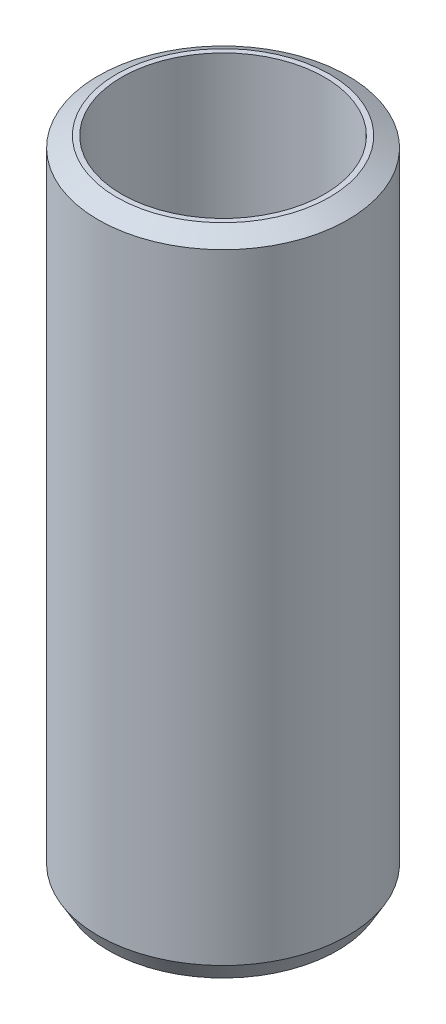
ISO-10303-21;
HEADER;
FILE_DESCRIPTION(('STEP AP214'),'2;1');
FILE_NAME('part.step','',(''),(''),'','','');
FILE_SCHEMA(('AUTOMOTIVE_DESIGN { 1 0 10303 214 1 1 1 1 }'));
ENDSEC;
DATA;
#1=APPLICATION_CONTEXT('core data for automotive mechanical design processes');
#2=APPLICATION_PROTOCOL_DEFINITION('international standard','automotive_design',2000,#1);
#3=PRODUCT_CONTEXT('',#1,'mechanical');
#4=PRODUCT('Part','Part','',(#3));
#5=PRODUCT_RELATED_PRODUCT_CATEGORY('part','',(#4));
#6=PRODUCT_DEFINITION_FORMATION('','',#4);
#7=PRODUCT_DEFINITION_CONTEXT('part definition',#1,'design');
#8=PRODUCT_DEFINITION('design','',#6,#7);
#9=PRODUCT_DEFINITION_SHAPE('','',#8);
#10=(LENGTH_UNIT() NAMED_UNIT(*) SI_UNIT(.MILLI.,.METRE.));
#11=(NAMED_UNIT(*) PLANE_ANGLE_UNIT() SI_UNIT($,.RADIAN.));
#12=(NAMED_UNIT(*) SI_UNIT($,.STERADIAN.) SOLID_ANGLE_UNIT());
#13=UNCERTAINTY_MEASURE_WITH_UNIT(LENGTH_MEASURE(1.E-05),#10,'distance_accuracy_value','');
#14=(GEOMETRIC_REPRESENTATION_CONTEXT(3) GLOBAL_UNCERTAINTY_ASSIGNED_CONTEXT((#13)) GLOBAL_UNIT_ASSIGNED_CONTEXT((#10,
#11,#12)) REPRESENTATION_CONTEXT('',''));
#15=CARTESIAN_POINT('',(0.,0.,0.));
#16=DIRECTION('',(0.,0.,1.));
#17=DIRECTION('',(1.,0.,0.));
#18=AXIS2_PLACEMENT_3D('',#15,#16,#17);
#19=CARTESIAN_POINT('',(0.,207.92294474515,0.));
#20=DIRECTION('',(0.,-1.,0.));
#21=DIRECTION('',(0.,0.,-1.));
#22=AXIS2_PLACEMENT_3D('',#19,#20,#21);
#23=CYLINDRICAL_SURFACE('',#22,40.);
#24=CARTESIAN_POINT('',(0.,204.552786412636,0.));
#25=DIRECTION('',(0.,1.,0.));
#26=DIRECTION('',(0.,0.,1.));
#27=AXIS2_PLACEMENT_3D('',#24,#25,#26);
#28=CIRCLE('',#27,40.);
#29=CARTESIAN_POINT('',(0.,204.552786412636,40.));
#30=VERTEX_POINT('',#29);
#31=EDGE_CURVE('E50',#30,#30,#28,.F.);
#32=ORIENTED_EDGE('',*,*,#31,.T.);
#33=EDGE_LOOP('',(#32));
#34=FACE_BOUND('',#33,.T.);
#35=CARTESIAN_POINT('',(0.,5.83728546146534,0.));
#36=DIRECTION('',(0.,1.,0.));
#37=DIRECTION('',(0.,0.,1.));
#38=AXIS2_PLACEMENT_3D('',#35,#36,#37);
#39=CIRCLE('',#38,40.);
#40=CARTESIAN_POINT('',(0.,5.83728546146534,40.));
#41=VERTEX_POINT('',#40);
#42=EDGE_CURVE('E51',#41,#41,#39,.T.);
#43=ORIENTED_EDGE('',*,*,#42,.T.);
#44=EDGE_LOOP('',(#43));
#45=FACE_BOUND('',#44,.T.);
#46=ADVANCED_FACE('F39',(#34,#45),#23,.T.);
#47=CARTESIAN_POINT('',(0.,207.92294474515,0.));
#48=DIRECTION('',(0.,1.,0.));
#49=DIRECTION('',(0.,0.,1.));
#50=AXIS2_PLACEMENT_3D('',#47,#48,#49);
#51=PLANE('',#50);
#52=CARTESIAN_POINT('',(0.,207.92294474515,0.));
#53=DIRECTION('',(0.,1.,0.));
#54=DIRECTION('',(0.,0.,1.));
#55=AXIS2_PLACEMENT_3D('',#52,#53,#54);
#56=CIRCLE('',#55,34.1627145385347);
#57=CARTESIAN_POINT('',(0.,207.92294474515,34.1627145385347));
#58=VERTEX_POINT('',#57);
#59=EDGE_CURVE('E54',#58,#58,#56,.T.);
#60=ORIENTED_EDGE('',*,*,#59,.T.);
#61=EDGE_LOOP('',(#60));
#62=FACE_BOUND('',#61,.T.);
#63=CARTESIAN_POINT('',(0.,207.92294474515,0.));
#64=DIRECTION('',(0.,1.,0.));
#65=DIRECTION('',(0.,0.,1.));
#66=AXIS2_PLACEMENT_3D('',#63,#64,#65);
#67=CIRCLE('',#66,32.5014145810078);
#68=CARTESIAN_POINT('',(0.,207.92294474515,32.5014145810078));
#69=VERTEX_POINT('',#68);
#70=EDGE_CURVE('E58',#69,#69,#67,.T.);
#71=ORIENTED_EDGE('',*,*,#70,.F.);
#72=EDGE_LOOP('',(#71));
#73=FACE_BOUND('',#72,.T.);
#74=ADVANCED_FACE('F69',(#62,#73),#51,.T.);
#75=CARTESIAN_POINT('',(0.,0.,0.));
#76=DIRECTION('',(0.,1.,0.));
#77=DIRECTION('',(0.,0.,1.));
#78=AXIS2_PLACEMENT_3D('',#75,#76,#77);
#79=PLANE('',#78);
#80=CARTESIAN_POINT('',(0.,0.,0.));
#81=DIRECTION('',(0.,1.,0.));
#82=DIRECTION('',(0.,0.,1.));
#83=AXIS2_PLACEMENT_3D('',#80,#81,#82);
#84=CIRCLE('',#83,36.6298416674863);
#85=CARTESIAN_POINT('',(0.,0.,36.6298416674863));
#86=VERTEX_POINT('',#85);
#87=EDGE_CURVE('E10',#86,#86,#84,.F.);
#88=ORIENTED_EDGE('',*,*,#87,.T.);
#89=EDGE_LOOP('',(#88));
#90=FACE_BOUND('',#89,.T.);
#91=CARTESIAN_POINT('',(0.,0.,0.));
#92=DIRECTION('',(0.,1.,0.));
#93=DIRECTION('',(0.,0.,1.));
#94=AXIS2_PLACEMENT_3D('',#91,#92,#93);
#95=CIRCLE('',#94,32.5014145810078);
#96=CARTESIAN_POINT('',(0.,0.,32.5014145810078));
#97=VERTEX_POINT('',#96);
#98=EDGE_CURVE('E63',#97,#97,#95,.T.);
#99=ORIENTED_EDGE('',*,*,#98,.T.);
#100=EDGE_LOOP('',(#99));
#101=FACE_BOUND('',#100,.T.);
#102=ADVANCED_FACE('F75',(#90,#101),#79,.F.);
#103=CARTESIAN_POINT('',(0.,207.92294474515,0.));
#104=DIRECTION('',(0.,-1.,0.));
#105=DIRECTION('',(0.,0.,-1.));
#106=AXIS2_PLACEMENT_3D('',#103,#104,#105);
#107=CYLINDRICAL_SURFACE('',#106,32.5014145810078);
#108=ORIENTED_EDGE('',*,*,#70,.T.);
#109=EDGE_LOOP('',(#108));
#110=FACE_BOUND('',#109,.T.);
#111=ORIENTED_EDGE('',*,*,#98,.F.);
#112=EDGE_LOOP('',(#111));
#113=FACE_BOUND('',#112,.T.);
#114=ADVANCED_FACE('F70',(#110,#113),#107,.F.);
#115=CARTESIAN_POINT('',(0.,207.92294474515,0.));
#116=DIRECTION('',(0.,-1.,0.));
#117=DIRECTION('',(0.,0.,-1.));
#118=AXIS2_PLACEMENT_3D('',#115,#116,#117);
#119=CONICAL_SURFACE('',#118,34.1627145385347,1.04719755119659);
#120=ORIENTED_EDGE('',*,*,#31,.F.);
#121=EDGE_LOOP('',(#120));
#122=FACE_BOUND('',#121,.T.);
#123=ORIENTED_EDGE('',*,*,#59,.F.);
#124=EDGE_LOOP('',(#123));
#125=FACE_BOUND('',#124,.T.);
#126=ADVANCED_FACE('F81',(#122,#125),#119,.T.);
#127=CARTESIAN_POINT('',(0.,5.83728546146534,0.));
#128=DIRECTION('',(0.,1.,0.));
#129=DIRECTION('',(0.,0.,1.));
#130=AXIS2_PLACEMENT_3D('',#127,#128,#129);
#131=CONICAL_SURFACE('',#130,40.,0.523598775598304);
#132=ORIENTED_EDGE('',*,*,#87,.F.);
#133=EDGE_LOOP('',(#132));
#134=FACE_BOUND('',#133,.T.);
#135=ORIENTED_EDGE('',*,*,#42,.F.);
#136=EDGE_LOOP('',(#135));
#137=FACE_BOUND('',#136,.T.);
#138=ADVANCED_FACE('F45',(#134,#137),#131,.T.);
#139=CLOSED_SHELL('',(#46,#74,#102,#114,#126,#138));
#140=MANIFOLD_SOLID_BREP('B2',#139);
#141=ADVANCED_BREP_SHAPE_REPRESENTATION('',(#18,#140),#14);
#142=SHAPE_DEFINITION_REPRESENTATION(#9,#141);
ENDSEC;
END-ISO-10303-21;
